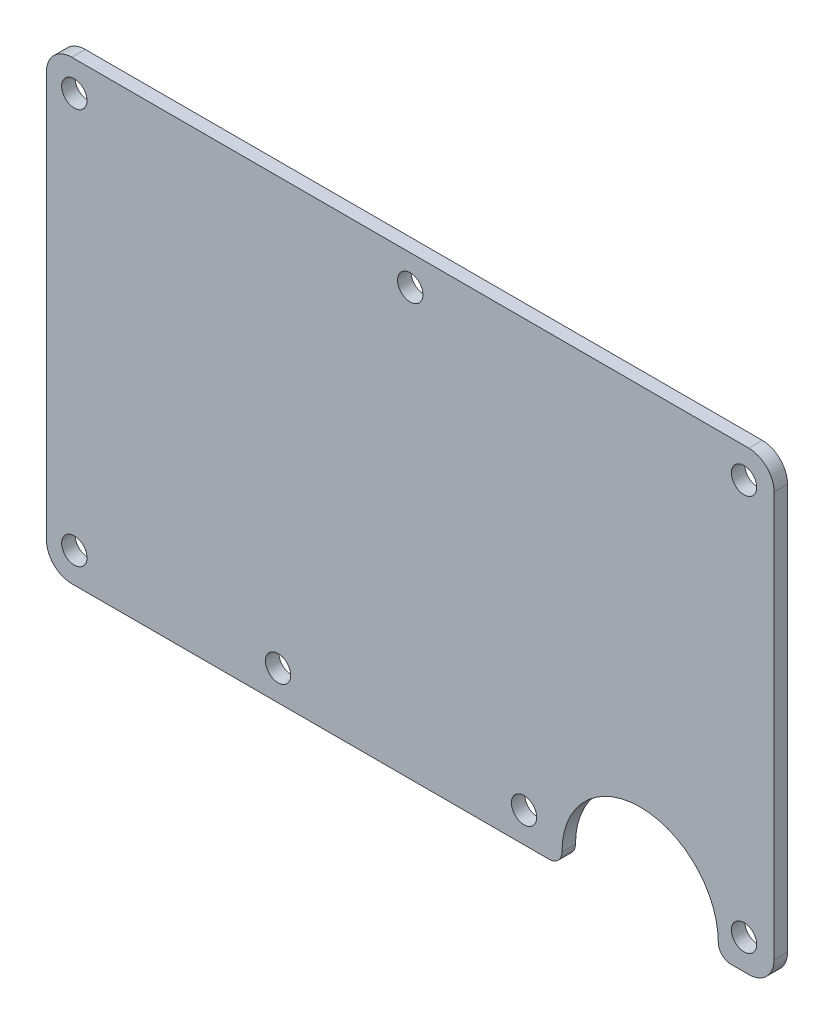
ISO-10303-21;
HEADER;
FILE_DESCRIPTION(('STEP AP214'),'2;1');
FILE_NAME('part.step','',(''),(''),'','','');
FILE_SCHEMA(('AUTOMOTIVE_DESIGN { 1 0 10303 214 1 1 1 1 }'));
ENDSEC;
DATA;
#1=APPLICATION_CONTEXT('core data for automotive mechanical design processes');
#2=APPLICATION_PROTOCOL_DEFINITION('international standard','automotive_design',2000,#1);
#3=PRODUCT_CONTEXT('',#1,'mechanical');
#4=PRODUCT('Part','Part','',(#3));
#5=PRODUCT_RELATED_PRODUCT_CATEGORY('part','',(#4));
#6=PRODUCT_DEFINITION_FORMATION('','',#4);
#7=PRODUCT_DEFINITION_CONTEXT('part definition',#1,'design');
#8=PRODUCT_DEFINITION('design','',#6,#7);
#9=PRODUCT_DEFINITION_SHAPE('','',#8);
#10=(LENGTH_UNIT() NAMED_UNIT(*) SI_UNIT(.MILLI.,.METRE.));
#11=(NAMED_UNIT(*) PLANE_ANGLE_UNIT() SI_UNIT($,.RADIAN.));
#12=(NAMED_UNIT(*) SI_UNIT($,.STERADIAN.) SOLID_ANGLE_UNIT());
#13=UNCERTAINTY_MEASURE_WITH_UNIT(LENGTH_MEASURE(1.E-05),#10,'distance_accuracy_value','');
#14=(GEOMETRIC_REPRESENTATION_CONTEXT(3) GLOBAL_UNCERTAINTY_ASSIGNED_CONTEXT((#13)) GLOBAL_UNIT_ASSIGNED_CONTEXT((#10,
#11,#12)) REPRESENTATION_CONTEXT('',''));
#15=CARTESIAN_POINT('',(0.,0.,0.));
#16=DIRECTION('',(0.,0.,1.));
#17=DIRECTION('',(1.,0.,0.));
#18=AXIS2_PLACEMENT_3D('',#15,#16,#17);
#19=CARTESIAN_POINT('',(3.,50.9476,0.));
#20=DIRECTION('',(0.,0.,1.));
#21=DIRECTION('',(1.,0.,0.));
#22=AXIS2_PLACEMENT_3D('',#19,#20,#21);
#23=CYLINDRICAL_SURFACE('',#22,3.);
#24=CARTESIAN_POINT('',(3.,50.9476,1.6));
#25=DIRECTION('',(0.,0.,1.));
#26=DIRECTION('',(1.,0.,0.));
#27=AXIS2_PLACEMENT_3D('',#24,#25,#26);
#28=CIRCLE('',#27,3.);
#29=CARTESIAN_POINT('',(3.,53.9476,1.6));
#30=VERTEX_POINT('',#29);
#31=CARTESIAN_POINT('',(0.,50.9476,1.6));
#32=VERTEX_POINT('',#31);
#33=EDGE_CURVE('E155',#30,#32,#28,.T.);
#34=ORIENTED_EDGE('',*,*,#33,.F.);
#35=DIRECTION('',(0.,0.,1.));
#36=VECTOR('',#35,1.);
#37=CARTESIAN_POINT('',(3.,53.9476,0.));
#38=LINE('',#37,#36);
#39=CARTESIAN_POINT('',(3.,53.9476,0.));
#40=VERTEX_POINT('',#39);
#41=EDGE_CURVE('E11',#40,#30,#38,.T.);
#42=ORIENTED_EDGE('',*,*,#41,.F.);
#43=CARTESIAN_POINT('',(3.,50.9476,0.));
#44=DIRECTION('',(0.,0.,1.));
#45=DIRECTION('',(1.,0.,0.));
#46=AXIS2_PLACEMENT_3D('',#43,#44,#45);
#47=CIRCLE('',#46,3.);
#48=CARTESIAN_POINT('',(0.,50.9476,0.));
#49=VERTEX_POINT('',#48);
#50=EDGE_CURVE('E188',#40,#49,#47,.T.);
#51=ORIENTED_EDGE('',*,*,#50,.T.);
#52=DIRECTION('',(0.,0.,1.));
#53=VECTOR('',#52,1.);
#54=CARTESIAN_POINT('',(0.,50.9476,0.));
#55=LINE('',#54,#53);
#56=EDGE_CURVE('E37',#49,#32,#55,.T.);
#57=ORIENTED_EDGE('',*,*,#56,.T.);
#58=EDGE_LOOP('',(#34,#42,#51,#57));
#59=FACE_BOUND('',#58,.T.);
#60=ADVANCED_FACE('F34',(#59),#23,.T.);
#61=CARTESIAN_POINT('',(83.1,53.9476,0.));
#62=DIRECTION('',(0.,1.,0.));
#63=DIRECTION('',(0.,0.,1.));
#64=AXIS2_PLACEMENT_3D('',#61,#62,#63);
#65=PLANE('',#64);
#66=DIRECTION('',(-1.,0.,0.));
#67=VECTOR('',#66,1.);
#68=CARTESIAN_POINT('',(83.1,53.9476,1.6));
#69=LINE('',#68,#67);
#70=CARTESIAN_POINT('',(83.1,53.9476,1.6));
#71=VERTEX_POINT('',#70);
#72=EDGE_CURVE('E186',#71,#30,#69,.T.);
#73=ORIENTED_EDGE('',*,*,#72,.F.);
#74=DIRECTION('',(0.,0.,1.));
#75=VECTOR('',#74,1.);
#76=CARTESIAN_POINT('',(83.1,53.9476,0.));
#77=LINE('',#76,#75);
#78=CARTESIAN_POINT('',(83.1,53.9476,0.));
#79=VERTEX_POINT('',#78);
#80=EDGE_CURVE('E43',#79,#71,#77,.T.);
#81=ORIENTED_EDGE('',*,*,#80,.F.);
#82=DIRECTION('',(-1.,0.,0.));
#83=VECTOR('',#82,1.);
#84=CARTESIAN_POINT('',(83.1,53.9476,0.));
#85=LINE('',#84,#83);
#86=EDGE_CURVE('E145',#79,#40,#85,.T.);
#87=ORIENTED_EDGE('',*,*,#86,.T.);
#88=ORIENTED_EDGE('',*,*,#41,.T.);
#89=EDGE_LOOP('',(#73,#81,#87,#88));
#90=FACE_BOUND('',#89,.T.);
#91=ADVANCED_FACE('F208',(#90),#65,.T.);
#92=CARTESIAN_POINT('',(83.1,50.9476,0.));
#93=DIRECTION('',(0.,0.,1.));
#94=DIRECTION('',(1.,0.,0.));
#95=AXIS2_PLACEMENT_3D('',#92,#93,#94);
#96=CYLINDRICAL_SURFACE('',#95,3.);
#97=CARTESIAN_POINT('',(83.1,50.9476,1.6));
#98=DIRECTION('',(0.,0.,1.));
#99=DIRECTION('',(1.,0.,0.));
#100=AXIS2_PLACEMENT_3D('',#97,#98,#99);
#101=CIRCLE('',#100,3.);
#102=CARTESIAN_POINT('',(86.1,50.9476,1.6));
#103=VERTEX_POINT('',#102);
#104=EDGE_CURVE('E132',#103,#71,#101,.T.);
#105=ORIENTED_EDGE('',*,*,#104,.F.);
#106=DIRECTION('',(0.,0.,1.));
#107=VECTOR('',#106,1.);
#108=CARTESIAN_POINT('',(86.1,50.9476,0.));
#109=LINE('',#108,#107);
#110=CARTESIAN_POINT('',(86.1,50.9476,0.));
#111=VERTEX_POINT('',#110);
#112=EDGE_CURVE('E127',#111,#103,#109,.T.);
#113=ORIENTED_EDGE('',*,*,#112,.F.);
#114=CARTESIAN_POINT('',(83.1,50.9476,0.));
#115=DIRECTION('',(0.,0.,1.));
#116=DIRECTION('',(1.,0.,0.));
#117=AXIS2_PLACEMENT_3D('',#114,#115,#116);
#118=CIRCLE('',#117,3.);
#119=EDGE_CURVE('E130',#111,#79,#118,.T.);
#120=ORIENTED_EDGE('',*,*,#119,.T.);
#121=ORIENTED_EDGE('',*,*,#80,.T.);
#122=EDGE_LOOP('',(#105,#113,#120,#121));
#123=FACE_BOUND('',#122,.T.);
#124=ADVANCED_FACE('F129',(#123),#96,.T.);
#125=CARTESIAN_POINT('',(86.1,3.,0.));
#126=DIRECTION('',(1.,0.,0.));
#127=DIRECTION('',(0.,0.,-1.));
#128=AXIS2_PLACEMENT_3D('',#125,#126,#127);
#129=PLANE('',#128);
#130=DIRECTION('',(0.,1.,0.));
#131=VECTOR('',#130,1.);
#132=CARTESIAN_POINT('',(86.1,3.,1.6));
#133=LINE('',#132,#131);
#134=CARTESIAN_POINT('',(86.1,3.,1.6));
#135=VERTEX_POINT('',#134);
#136=EDGE_CURVE('E183',#135,#103,#133,.T.);
#137=ORIENTED_EDGE('',*,*,#136,.F.);
#138=DIRECTION('',(0.,0.,1.));
#139=VECTOR('',#138,1.);
#140=CARTESIAN_POINT('',(86.1,3.,0.));
#141=LINE('',#140,#139);
#142=CARTESIAN_POINT('',(86.1,3.,0.));
#143=VERTEX_POINT('',#142);
#144=EDGE_CURVE('E137',#143,#135,#141,.T.);
#145=ORIENTED_EDGE('',*,*,#144,.F.);
#146=DIRECTION('',(0.,1.,0.));
#147=VECTOR('',#146,1.);
#148=CARTESIAN_POINT('',(86.1,3.,0.));
#149=LINE('',#148,#147);
#150=EDGE_CURVE('E143',#143,#111,#149,.T.);
#151=ORIENTED_EDGE('',*,*,#150,.T.);
#152=ORIENTED_EDGE('',*,*,#112,.T.);
#153=EDGE_LOOP('',(#137,#145,#151,#152));
#154=FACE_BOUND('',#153,.T.);
#155=ADVANCED_FACE('F147',(#154),#129,.T.);
#156=CARTESIAN_POINT('',(83.1,3.,0.));
#157=DIRECTION('',(0.,0.,1.));
#158=DIRECTION('',(1.,0.,0.));
#159=AXIS2_PLACEMENT_3D('',#156,#157,#158);
#160=CYLINDRICAL_SURFACE('',#159,3.);
#161=CARTESIAN_POINT('',(83.1,3.,1.6));
#162=DIRECTION('',(0.,0.,1.));
#163=DIRECTION('',(1.,0.,0.));
#164=AXIS2_PLACEMENT_3D('',#161,#162,#163);
#165=CIRCLE('',#164,3.);
#166=CARTESIAN_POINT('',(83.1,0.,1.6));
#167=VERTEX_POINT('',#166);
#168=EDGE_CURVE('E180',#167,#135,#165,.T.);
#169=ORIENTED_EDGE('',*,*,#168,.F.);
#170=DIRECTION('',(0.,0.,1.));
#171=VECTOR('',#170,1.);
#172=CARTESIAN_POINT('',(83.1,0.,0.));
#173=LINE('',#172,#171);
#174=CARTESIAN_POINT('',(83.1,0.,0.));
#175=VERTEX_POINT('',#174);
#176=EDGE_CURVE('E192',#175,#167,#173,.T.);
#177=ORIENTED_EDGE('',*,*,#176,.F.);
#178=CARTESIAN_POINT('',(83.1,3.,0.));
#179=DIRECTION('',(0.,0.,1.));
#180=DIRECTION('',(1.,0.,0.));
#181=AXIS2_PLACEMENT_3D('',#178,#179,#180);
#182=CIRCLE('',#181,3.);
#183=EDGE_CURVE('E148',#175,#143,#182,.T.);
#184=ORIENTED_EDGE('',*,*,#183,.T.);
#185=ORIENTED_EDGE('',*,*,#144,.T.);
#186=EDGE_LOOP('',(#169,#177,#184,#185));
#187=FACE_BOUND('',#186,.T.);
#188=ADVANCED_FACE('F221',(#187),#160,.T.);
#189=CARTESIAN_POINT('',(81.,0.,0.));
#190=DIRECTION('',(0.,-1.,0.));
#191=DIRECTION('',(0.,0.,-1.));
#192=AXIS2_PLACEMENT_3D('',#189,#190,#191);
#193=PLANE('',#192);
#194=DIRECTION('',(1.,0.,0.));
#195=VECTOR('',#194,1.);
#196=CARTESIAN_POINT('',(81.,0.,1.6));
#197=LINE('',#196,#195);
#198=CARTESIAN_POINT('',(81.,0.,1.6));
#199=VERTEX_POINT('',#198);
#200=EDGE_CURVE('E177',#199,#167,#197,.T.);
#201=ORIENTED_EDGE('',*,*,#200,.F.);
#202=DIRECTION('',(0.,0.,1.));
#203=VECTOR('',#202,1.);
#204=CARTESIAN_POINT('',(81.,0.,0.));
#205=LINE('',#204,#203);
#206=CARTESIAN_POINT('',(81.,0.,0.));
#207=VERTEX_POINT('',#206);
#208=EDGE_CURVE('E194',#207,#199,#205,.T.);
#209=ORIENTED_EDGE('',*,*,#208,.F.);
#210=DIRECTION('',(1.,0.,0.));
#211=VECTOR('',#210,1.);
#212=CARTESIAN_POINT('',(81.,0.,0.));
#213=LINE('',#212,#211);
#214=EDGE_CURVE('E150',#207,#175,#213,.T.);
#215=ORIENTED_EDGE('',*,*,#214,.T.);
#216=ORIENTED_EDGE('',*,*,#176,.T.);
#217=EDGE_LOOP('',(#201,#209,#215,#216));
#218=FACE_BOUND('',#217,.T.);
#219=ADVANCED_FACE('F224',(#218),#193,.T.);
#220=CARTESIAN_POINT('',(81.,1.5,0.));
#221=DIRECTION('',(0.,0.,1.));
#222=DIRECTION('',(1.,0.,0.));
#223=AXIS2_PLACEMENT_3D('',#220,#221,#222);
#224=CYLINDRICAL_SURFACE('',#223,1.5);
#225=CARTESIAN_POINT('',(81.,1.5,1.6));
#226=DIRECTION('',(0.,0.,1.));
#227=DIRECTION('',(1.,0.,0.));
#228=AXIS2_PLACEMENT_3D('',#225,#226,#227);
#229=CIRCLE('',#228,1.5);
#230=CARTESIAN_POINT('',(79.5,1.5,1.6));
#231=VERTEX_POINT('',#230);
#232=EDGE_CURVE('E174',#231,#199,#229,.T.);
#233=ORIENTED_EDGE('',*,*,#232,.F.);
#234=DIRECTION('',(0.,0.,1.));
#235=VECTOR('',#234,1.);
#236=CARTESIAN_POINT('',(79.5,1.5,0.));
#237=LINE('',#236,#235);
#238=CARTESIAN_POINT('',(79.5,1.5,0.));
#239=VERTEX_POINT('',#238);
#240=EDGE_CURVE('E196',#239,#231,#237,.T.);
#241=ORIENTED_EDGE('',*,*,#240,.F.);
#242=CARTESIAN_POINT('',(81.,1.5,0.));
#243=DIRECTION('',(0.,0.,1.));
#244=DIRECTION('',(1.,0.,0.));
#245=AXIS2_PLACEMENT_3D('',#242,#243,#244);
#246=CIRCLE('',#245,1.5);
#247=EDGE_CURVE('E348',#239,#207,#246,.T.);
#248=ORIENTED_EDGE('',*,*,#247,.T.);
#249=ORIENTED_EDGE('',*,*,#208,.T.);
#250=EDGE_LOOP('',(#233,#241,#248,#249));
#251=FACE_BOUND('',#250,.T.);
#252=ADVANCED_FACE('F228',(#251),#224,.T.);
#253=CARTESIAN_POINT('',(70.25,1.5,0.));
#254=DIRECTION('',(0.,0.,1.));
#255=DIRECTION('',(1.,0.,0.));
#256=AXIS2_PLACEMENT_3D('',#253,#254,#255);
#257=CYLINDRICAL_SURFACE('',#256,9.25);
#258=CARTESIAN_POINT('',(70.25,1.5,1.6));
#259=DIRECTION('',(0.,0.,-1.));
#260=DIRECTION('',(-1.,0.,0.));
#261=AXIS2_PLACEMENT_3D('',#258,#259,#260);
#262=CIRCLE('',#261,9.25);
#263=CARTESIAN_POINT('',(61.,1.5,1.6));
#264=VERTEX_POINT('',#263);
#265=EDGE_CURVE('E171',#264,#231,#262,.T.);
#266=ORIENTED_EDGE('',*,*,#265,.F.);
#267=DIRECTION('',(0.,0.,1.));
#268=VECTOR('',#267,1.);
#269=CARTESIAN_POINT('',(61.,1.5,0.));
#270=LINE('',#269,#268);
#271=CARTESIAN_POINT('',(61.,1.5,0.));
#272=VERTEX_POINT('',#271);
#273=EDGE_CURVE('E198',#272,#264,#270,.T.);
#274=ORIENTED_EDGE('',*,*,#273,.F.);
#275=CARTESIAN_POINT('',(70.25,1.5,0.));
#276=DIRECTION('',(0.,0.,-1.));
#277=DIRECTION('',(-1.,0.,0.));
#278=AXIS2_PLACEMENT_3D('',#275,#276,#277);
#279=CIRCLE('',#278,9.25);
#280=EDGE_CURVE('E345',#272,#239,#279,.T.);
#281=ORIENTED_EDGE('',*,*,#280,.T.);
#282=ORIENTED_EDGE('',*,*,#240,.T.);
#283=EDGE_LOOP('',(#266,#274,#281,#282));
#284=FACE_BOUND('',#283,.T.);
#285=ADVANCED_FACE('F232',(#284),#257,.F.);
#286=CARTESIAN_POINT('',(59.5,1.5,0.));
#287=DIRECTION('',(0.,0.,1.));
#288=DIRECTION('',(1.,0.,0.));
#289=AXIS2_PLACEMENT_3D('',#286,#287,#288);
#290=CYLINDRICAL_SURFACE('',#289,1.5);
#291=CARTESIAN_POINT('',(59.5,1.5,1.6));
#292=DIRECTION('',(0.,0.,1.));
#293=DIRECTION('',(1.,0.,0.));
#294=AXIS2_PLACEMENT_3D('',#291,#292,#293);
#295=CIRCLE('',#294,1.5);
#296=CARTESIAN_POINT('',(59.5,0.,1.6));
#297=VERTEX_POINT('',#296);
#298=EDGE_CURVE('E168',#297,#264,#295,.T.);
#299=ORIENTED_EDGE('',*,*,#298,.F.);
#300=DIRECTION('',(0.,0.,1.));
#301=VECTOR('',#300,1.);
#302=CARTESIAN_POINT('',(59.5,0.,0.));
#303=LINE('',#302,#301);
#304=CARTESIAN_POINT('',(59.5,0.,0.));
#305=VERTEX_POINT('',#304);
#306=EDGE_CURVE('E200',#305,#297,#303,.T.);
#307=ORIENTED_EDGE('',*,*,#306,.F.);
#308=CARTESIAN_POINT('',(59.5,1.5,0.));
#309=DIRECTION('',(0.,0.,1.));
#310=DIRECTION('',(1.,0.,0.));
#311=AXIS2_PLACEMENT_3D('',#308,#309,#310);
#312=CIRCLE('',#311,1.5);
#313=EDGE_CURVE('E342',#305,#272,#312,.T.);
#314=ORIENTED_EDGE('',*,*,#313,.T.);
#315=ORIENTED_EDGE('',*,*,#273,.T.);
#316=EDGE_LOOP('',(#299,#307,#314,#315));
#317=FACE_BOUND('',#316,.T.);
#318=ADVANCED_FACE('F236',(#317),#290,.T.);
#319=CARTESIAN_POINT('',(3.,0.,0.));
#320=DIRECTION('',(0.,-1.,0.));
#321=DIRECTION('',(0.,0.,-1.));
#322=AXIS2_PLACEMENT_3D('',#319,#320,#321);
#323=PLANE('',#322);
#324=DIRECTION('',(1.,0.,0.));
#325=VECTOR('',#324,1.);
#326=CARTESIAN_POINT('',(3.,0.,1.6));
#327=LINE('',#326,#325);
#328=CARTESIAN_POINT('',(3.,0.,1.6));
#329=VERTEX_POINT('',#328);
#330=EDGE_CURVE('E165',#329,#297,#327,.T.);
#331=ORIENTED_EDGE('',*,*,#330,.F.);
#332=DIRECTION('',(0.,0.,1.));
#333=VECTOR('',#332,1.);
#334=CARTESIAN_POINT('',(3.,0.,0.));
#335=LINE('',#334,#333);
#336=CARTESIAN_POINT('',(3.,0.,0.));
#337=VERTEX_POINT('',#336);
#338=EDGE_CURVE('E202',#337,#329,#335,.T.);
#339=ORIENTED_EDGE('',*,*,#338,.F.);
#340=DIRECTION('',(1.,0.,0.));
#341=VECTOR('',#340,1.);
#342=CARTESIAN_POINT('',(3.,0.,0.));
#343=LINE('',#342,#341);
#344=EDGE_CURVE('E339',#337,#305,#343,.T.);
#345=ORIENTED_EDGE('',*,*,#344,.T.);
#346=ORIENTED_EDGE('',*,*,#306,.T.);
#347=EDGE_LOOP('',(#331,#339,#345,#346));
#348=FACE_BOUND('',#347,.T.);
#349=ADVANCED_FACE('F240',(#348),#323,.T.);
#350=CARTESIAN_POINT('',(3.,3.,0.));
#351=DIRECTION('',(0.,0.,1.));
#352=DIRECTION('',(1.,0.,0.));
#353=AXIS2_PLACEMENT_3D('',#350,#351,#352);
#354=CYLINDRICAL_SURFACE('',#353,3.);
#355=CARTESIAN_POINT('',(3.,3.,1.6));
#356=DIRECTION('',(0.,0.,1.));
#357=DIRECTION('',(1.,0.,0.));
#358=AXIS2_PLACEMENT_3D('',#355,#356,#357);
#359=CIRCLE('',#358,3.);
#360=CARTESIAN_POINT('',(0.,3.,1.6));
#361=VERTEX_POINT('',#360);
#362=EDGE_CURVE('E162',#361,#329,#359,.T.);
#363=ORIENTED_EDGE('',*,*,#362,.F.);
#364=DIRECTION('',(0.,0.,1.));
#365=VECTOR('',#364,1.);
#366=CARTESIAN_POINT('',(0.,3.,0.));
#367=LINE('',#366,#365);
#368=CARTESIAN_POINT('',(0.,3.,0.));
#369=VERTEX_POINT('',#368);
#370=EDGE_CURVE('E203',#369,#361,#367,.T.);
#371=ORIENTED_EDGE('',*,*,#370,.F.);
#372=CARTESIAN_POINT('',(3.,3.,0.));
#373=DIRECTION('',(0.,0.,1.));
#374=DIRECTION('',(1.,0.,0.));
#375=AXIS2_PLACEMENT_3D('',#372,#373,#374);
#376=CIRCLE('',#375,3.);
#377=EDGE_CURVE('E336',#369,#337,#376,.T.);
#378=ORIENTED_EDGE('',*,*,#377,.T.);
#379=ORIENTED_EDGE('',*,*,#338,.T.);
#380=EDGE_LOOP('',(#363,#371,#378,#379));
#381=FACE_BOUND('',#380,.T.);
#382=ADVANCED_FACE('F244',(#381),#354,.T.);
#383=CARTESIAN_POINT('',(0.,50.9476,0.));
#384=DIRECTION('',(-1.,0.,0.));
#385=DIRECTION('',(0.,0.,1.));
#386=AXIS2_PLACEMENT_3D('',#383,#384,#385);
#387=PLANE('',#386);
#388=DIRECTION('',(0.,-1.,0.));
#389=VECTOR('',#388,1.);
#390=CARTESIAN_POINT('',(0.,50.9476,1.6));
#391=LINE('',#390,#389);
#392=EDGE_CURVE('E158',#32,#361,#391,.T.);
#393=ORIENTED_EDGE('',*,*,#392,.F.);
#394=ORIENTED_EDGE('',*,*,#56,.F.);
#395=DIRECTION('',(0.,-1.,0.));
#396=VECTOR('',#395,1.);
#397=CARTESIAN_POINT('',(0.,50.9476,0.));
#398=LINE('',#397,#396);
#399=EDGE_CURVE('E334',#49,#369,#398,.T.);
#400=ORIENTED_EDGE('',*,*,#399,.T.);
#401=ORIENTED_EDGE('',*,*,#370,.T.);
#402=EDGE_LOOP('',(#393,#394,#400,#401));
#403=FACE_BOUND('',#402,.T.);
#404=ADVANCED_FACE('F205',(#403),#387,.T.);
#405=CARTESIAN_POINT('',(3.,50.9476,0.));
#406=DIRECTION('',(0.,0.,1.));
#407=DIRECTION('',(1.,0.,0.));
#408=AXIS2_PLACEMENT_3D('',#405,#406,#407);
#409=PLANE('',#408);
#410=CARTESIAN_POINT('',(43.05,50.3904,0.));
#411=DIRECTION('',(0.,0.,1.));
#412=DIRECTION('',(-1.,0.,0.));
#413=AXIS2_PLACEMENT_3D('',#410,#411,#412);
#414=CIRCLE('',#413,1.5);
#415=CARTESIAN_POINT('',(41.55,50.3904,0.));
#416=VERTEX_POINT('',#415);
#417=EDGE_CURVE('E291',#416,#416,#414,.T.);
#418=ORIENTED_EDGE('',*,*,#417,.T.);
#419=EDGE_LOOP('',(#418));
#420=FACE_BOUND('',#419,.T.);
#421=CARTESIAN_POINT('',(56.515,3.556,0.));
#422=DIRECTION('',(0.,0.,1.));
#423=DIRECTION('',(-1.,0.,0.));
#424=AXIS2_PLACEMENT_3D('',#421,#422,#423);
#425=CIRCLE('',#424,1.5);
#426=CARTESIAN_POINT('',(55.015,3.556,0.));
#427=VERTEX_POINT('',#426);
#428=EDGE_CURVE('E299',#427,#427,#425,.T.);
#429=ORIENTED_EDGE('',*,*,#428,.T.);
#430=EDGE_LOOP('',(#429));
#431=FACE_BOUND('',#430,.T.);
#432=CARTESIAN_POINT('',(27.4096,3.556,0.));
#433=DIRECTION('',(0.,0.,1.));
#434=DIRECTION('',(-1.,0.,0.));
#435=AXIS2_PLACEMENT_3D('',#432,#433,#434);
#436=CIRCLE('',#435,1.4999995);
#437=CARTESIAN_POINT('',(25.9096005,3.556,0.));
#438=VERTEX_POINT('',#437);
#439=EDGE_CURVE('E305',#438,#438,#436,.T.);
#440=ORIENTED_EDGE('',*,*,#439,.T.);
#441=EDGE_LOOP('',(#440));
#442=FACE_BOUND('',#441,.T.);
#443=CARTESIAN_POINT('',(82.55,50.3904,0.));
#444=DIRECTION('',(0.,0.,1.));
#445=DIRECTION('',(-1.,0.,0.));
#446=AXIS2_PLACEMENT_3D('',#443,#444,#445);
#447=CIRCLE('',#446,1.5);
#448=CARTESIAN_POINT('',(81.05,50.3904,0.));
#449=VERTEX_POINT('',#448);
#450=EDGE_CURVE('E311',#449,#449,#447,.T.);
#451=ORIENTED_EDGE('',*,*,#450,.T.);
#452=EDGE_LOOP('',(#451));
#453=FACE_BOUND('',#452,.T.);
#454=CARTESIAN_POINT('',(82.55,3.556,0.));
#455=DIRECTION('',(0.,0.,1.));
#456=DIRECTION('',(-1.,0.,0.));
#457=AXIS2_PLACEMENT_3D('',#454,#455,#456);
#458=CIRCLE('',#457,1.5);
#459=CARTESIAN_POINT('',(81.05,3.556,0.));
#460=VERTEX_POINT('',#459);
#461=EDGE_CURVE('E317',#460,#460,#458,.T.);
#462=ORIENTED_EDGE('',*,*,#461,.T.);
#463=EDGE_LOOP('',(#462));
#464=FACE_BOUND('',#463,.T.);
#465=CARTESIAN_POINT('',(3.302,3.556,0.));
#466=DIRECTION('',(0.,0.,1.));
#467=DIRECTION('',(-1.,0.,0.));
#468=AXIS2_PLACEMENT_3D('',#465,#466,#467);
#469=CIRCLE('',#468,1.5);
#470=CARTESIAN_POINT('',(1.802,3.556,0.));
#471=VERTEX_POINT('',#470);
#472=EDGE_CURVE('E323',#471,#471,#469,.T.);
#473=ORIENTED_EDGE('',*,*,#472,.T.);
#474=EDGE_LOOP('',(#473));
#475=FACE_BOUND('',#474,.T.);
#476=CARTESIAN_POINT('',(3.302,50.3904,0.));
#477=DIRECTION('',(0.,0.,1.));
#478=DIRECTION('',(-1.,0.,0.));
#479=AXIS2_PLACEMENT_3D('',#476,#477,#478);
#480=CIRCLE('',#479,1.5);
#481=CARTESIAN_POINT('',(1.802,50.3904,0.));
#482=VERTEX_POINT('',#481);
#483=EDGE_CURVE('E159',#482,#482,#480,.T.);
#484=ORIENTED_EDGE('',*,*,#483,.T.);
#485=EDGE_LOOP('',(#484));
#486=FACE_BOUND('',#485,.T.);
#487=ORIENTED_EDGE('',*,*,#50,.F.);
#488=ORIENTED_EDGE('',*,*,#86,.F.);
#489=ORIENTED_EDGE('',*,*,#119,.F.);
#490=ORIENTED_EDGE('',*,*,#150,.F.);
#491=ORIENTED_EDGE('',*,*,#183,.F.);
#492=ORIENTED_EDGE('',*,*,#214,.F.);
#493=ORIENTED_EDGE('',*,*,#247,.F.);
#494=ORIENTED_EDGE('',*,*,#280,.F.);
#495=ORIENTED_EDGE('',*,*,#313,.F.);
#496=ORIENTED_EDGE('',*,*,#344,.F.);
#497=ORIENTED_EDGE('',*,*,#377,.F.);
#498=ORIENTED_EDGE('',*,*,#399,.F.);
#499=EDGE_LOOP('',(#487,#488,#489,#490,#491,#492,#493,#494,#495,#496,#497,#498));
#500=FACE_BOUND('',#499,.T.);
#501=ADVANCED_FACE('F141',(#420,#431,#442,#453,#464,#475,#486,#500),#409,.F.);
#502=CARTESIAN_POINT('',(3.,50.9476,1.6));
#503=DIRECTION('',(0.,0.,1.));
#504=DIRECTION('',(1.,0.,0.));
#505=AXIS2_PLACEMENT_3D('',#502,#503,#504);
#506=PLANE('',#505);
#507=CARTESIAN_POINT('',(43.05,50.3904,1.6));
#508=DIRECTION('',(0.,0.,1.));
#509=DIRECTION('',(-1.,0.,0.));
#510=AXIS2_PLACEMENT_3D('',#507,#508,#509);
#511=CIRCLE('',#510,1.5);
#512=CARTESIAN_POINT('',(41.55,50.3904,1.6));
#513=VERTEX_POINT('',#512);
#514=EDGE_CURVE('E294',#513,#513,#511,.T.);
#515=ORIENTED_EDGE('',*,*,#514,.F.);
#516=EDGE_LOOP('',(#515));
#517=FACE_BOUND('',#516,.T.);
#518=CARTESIAN_POINT('',(56.515,3.556,1.6));
#519=DIRECTION('',(0.,0.,1.));
#520=DIRECTION('',(-1.,0.,0.));
#521=AXIS2_PLACEMENT_3D('',#518,#519,#520);
#522=CIRCLE('',#521,1.5);
#523=CARTESIAN_POINT('',(55.015,3.556,1.6));
#524=VERTEX_POINT('',#523);
#525=EDGE_CURVE('E296',#524,#524,#522,.T.);
#526=ORIENTED_EDGE('',*,*,#525,.F.);
#527=EDGE_LOOP('',(#526));
#528=FACE_BOUND('',#527,.T.);
#529=CARTESIAN_POINT('',(27.4096,3.556,1.6));
#530=DIRECTION('',(0.,0.,1.));
#531=DIRECTION('',(-1.,0.,0.));
#532=AXIS2_PLACEMENT_3D('',#529,#530,#531);
#533=CIRCLE('',#532,1.4999995);
#534=CARTESIAN_POINT('',(25.9096005,3.556,1.6));
#535=VERTEX_POINT('',#534);
#536=EDGE_CURVE('E302',#535,#535,#533,.T.);
#537=ORIENTED_EDGE('',*,*,#536,.F.);
#538=EDGE_LOOP('',(#537));
#539=FACE_BOUND('',#538,.T.);
#540=CARTESIAN_POINT('',(82.55,50.3904,1.6));
#541=DIRECTION('',(0.,0.,1.));
#542=DIRECTION('',(-1.,0.,0.));
#543=AXIS2_PLACEMENT_3D('',#540,#541,#542);
#544=CIRCLE('',#543,1.5);
#545=CARTESIAN_POINT('',(81.05,50.3904,1.6));
#546=VERTEX_POINT('',#545);
#547=EDGE_CURVE('E308',#546,#546,#544,.T.);
#548=ORIENTED_EDGE('',*,*,#547,.F.);
#549=EDGE_LOOP('',(#548));
#550=FACE_BOUND('',#549,.T.);
#551=CARTESIAN_POINT('',(82.55,3.556,1.6));
#552=DIRECTION('',(0.,0.,1.));
#553=DIRECTION('',(-1.,0.,0.));
#554=AXIS2_PLACEMENT_3D('',#551,#552,#553);
#555=CIRCLE('',#554,1.5);
#556=CARTESIAN_POINT('',(81.05,3.556,1.6));
#557=VERTEX_POINT('',#556);
#558=EDGE_CURVE('E314',#557,#557,#555,.T.);
#559=ORIENTED_EDGE('',*,*,#558,.F.);
#560=EDGE_LOOP('',(#559));
#561=FACE_BOUND('',#560,.T.);
#562=CARTESIAN_POINT('',(3.302,3.556,1.6));
#563=DIRECTION('',(0.,0.,1.));
#564=DIRECTION('',(-1.,0.,0.));
#565=AXIS2_PLACEMENT_3D('',#562,#563,#564);
#566=CIRCLE('',#565,1.5);
#567=CARTESIAN_POINT('',(1.802,3.556,1.6));
#568=VERTEX_POINT('',#567);
#569=EDGE_CURVE('E320',#568,#568,#566,.T.);
#570=ORIENTED_EDGE('',*,*,#569,.F.);
#571=EDGE_LOOP('',(#570));
#572=FACE_BOUND('',#571,.T.);
#573=CARTESIAN_POINT('',(3.302,50.3904,1.6));
#574=DIRECTION('',(0.,0.,1.));
#575=DIRECTION('',(-1.,0.,0.));
#576=AXIS2_PLACEMENT_3D('',#573,#574,#575);
#577=CIRCLE('',#576,1.5);
#578=CARTESIAN_POINT('',(1.802,50.3904,1.6));
#579=VERTEX_POINT('',#578);
#580=EDGE_CURVE('E326',#579,#579,#577,.T.);
#581=ORIENTED_EDGE('',*,*,#580,.F.);
#582=EDGE_LOOP('',(#581));
#583=FACE_BOUND('',#582,.T.);
#584=ORIENTED_EDGE('',*,*,#33,.T.);
#585=ORIENTED_EDGE('',*,*,#392,.T.);
#586=ORIENTED_EDGE('',*,*,#362,.T.);
#587=ORIENTED_EDGE('',*,*,#330,.T.);
#588=ORIENTED_EDGE('',*,*,#298,.T.);
#589=ORIENTED_EDGE('',*,*,#265,.T.);
#590=ORIENTED_EDGE('',*,*,#232,.T.);
#591=ORIENTED_EDGE('',*,*,#200,.T.);
#592=ORIENTED_EDGE('',*,*,#168,.T.);
#593=ORIENTED_EDGE('',*,*,#136,.T.);
#594=ORIENTED_EDGE('',*,*,#104,.T.);
#595=ORIENTED_EDGE('',*,*,#72,.T.);
#596=EDGE_LOOP('',(#584,#585,#586,#587,#588,#589,#590,#591,#592,#593,#594,#595));
#597=FACE_BOUND('',#596,.T.);
#598=ADVANCED_FACE('F207',(#517,#528,#539,#550,#561,#572,#583,#597),#506,.T.);
#599=CARTESIAN_POINT('',(3.302,50.3904,0.));
#600=DIRECTION('',(0.,0.,1.));
#601=DIRECTION('',(1.,0.,0.));
#602=AXIS2_PLACEMENT_3D('',#599,#600,#601);
#603=CYLINDRICAL_SURFACE('',#602,1.5);
#604=ORIENTED_EDGE('',*,*,#483,.F.);
#605=EDGE_LOOP('',(#604));
#606=FACE_BOUND('',#605,.T.);
#607=ORIENTED_EDGE('',*,*,#580,.T.);
#608=EDGE_LOOP('',(#607));
#609=FACE_BOUND('',#608,.T.);
#610=ADVANCED_FACE('F256',(#606,#609),#603,.F.);
#611=CARTESIAN_POINT('',(3.302,3.556,0.));
#612=DIRECTION('',(0.,0.,1.));
#613=DIRECTION('',(1.,0.,0.));
#614=AXIS2_PLACEMENT_3D('',#611,#612,#613);
#615=CYLINDRICAL_SURFACE('',#614,1.5);
#616=ORIENTED_EDGE('',*,*,#472,.F.);
#617=EDGE_LOOP('',(#616));
#618=FACE_BOUND('',#617,.T.);
#619=ORIENTED_EDGE('',*,*,#569,.T.);
#620=EDGE_LOOP('',(#619));
#621=FACE_BOUND('',#620,.T.);
#622=ADVANCED_FACE('F263',(#618,#621),#615,.F.);
#623=CARTESIAN_POINT('',(82.55,3.556,0.));
#624=DIRECTION('',(0.,0.,1.));
#625=DIRECTION('',(1.,0.,0.));
#626=AXIS2_PLACEMENT_3D('',#623,#624,#625);
#627=CYLINDRICAL_SURFACE('',#626,1.5);
#628=ORIENTED_EDGE('',*,*,#461,.F.);
#629=EDGE_LOOP('',(#628));
#630=FACE_BOUND('',#629,.T.);
#631=ORIENTED_EDGE('',*,*,#558,.T.);
#632=EDGE_LOOP('',(#631));
#633=FACE_BOUND('',#632,.T.);
#634=ADVANCED_FACE('F267',(#630,#633),#627,.F.);
#635=CARTESIAN_POINT('',(82.55,50.3904,0.));
#636=DIRECTION('',(0.,0.,1.));
#637=DIRECTION('',(1.,0.,0.));
#638=AXIS2_PLACEMENT_3D('',#635,#636,#637);
#639=CYLINDRICAL_SURFACE('',#638,1.5);
#640=ORIENTED_EDGE('',*,*,#450,.F.);
#641=EDGE_LOOP('',(#640));
#642=FACE_BOUND('',#641,.T.);
#643=ORIENTED_EDGE('',*,*,#547,.T.);
#644=EDGE_LOOP('',(#643));
#645=FACE_BOUND('',#644,.T.);
#646=ADVANCED_FACE('F271',(#642,#645),#639,.F.);
#647=CARTESIAN_POINT('',(27.4096,3.556,0.));
#648=DIRECTION('',(0.,0.,1.));
#649=DIRECTION('',(1.,0.,0.));
#650=AXIS2_PLACEMENT_3D('',#647,#648,#649);
#651=CYLINDRICAL_SURFACE('',#650,1.4999995);
#652=ORIENTED_EDGE('',*,*,#439,.F.);
#653=EDGE_LOOP('',(#652));
#654=FACE_BOUND('',#653,.T.);
#655=ORIENTED_EDGE('',*,*,#536,.T.);
#656=EDGE_LOOP('',(#655));
#657=FACE_BOUND('',#656,.T.);
#658=ADVANCED_FACE('F275',(#654,#657),#651,.F.);
#659=CARTESIAN_POINT('',(56.515,3.556,0.));
#660=DIRECTION('',(0.,0.,1.));
#661=DIRECTION('',(1.,0.,0.));
#662=AXIS2_PLACEMENT_3D('',#659,#660,#661);
#663=CYLINDRICAL_SURFACE('',#662,1.5);
#664=ORIENTED_EDGE('',*,*,#428,.F.);
#665=EDGE_LOOP('',(#664));
#666=FACE_BOUND('',#665,.T.);
#667=ORIENTED_EDGE('',*,*,#525,.T.);
#668=EDGE_LOOP('',(#667));
#669=FACE_BOUND('',#668,.T.);
#670=ADVANCED_FACE('F279',(#666,#669),#663,.F.);
#671=CARTESIAN_POINT('',(43.05,50.3904,0.));
#672=DIRECTION('',(0.,0.,1.));
#673=DIRECTION('',(1.,0.,0.));
#674=AXIS2_PLACEMENT_3D('',#671,#672,#673);
#675=CYLINDRICAL_SURFACE('',#674,1.5);
#676=ORIENTED_EDGE('',*,*,#417,.F.);
#677=EDGE_LOOP('',(#676));
#678=FACE_BOUND('',#677,.T.);
#679=ORIENTED_EDGE('',*,*,#514,.T.);
#680=EDGE_LOOP('',(#679));
#681=FACE_BOUND('',#680,.T.);
#682=ADVANCED_FACE('F283',(#678,#681),#675,.F.);
#683=CLOSED_SHELL('',(#60,#91,#124,#155,#188,#219,#252,#285,#318,#349,#382,#404,#501,#598,#610,
#622,#634,#646,#658,#670,#682));
#684=MANIFOLD_SOLID_BREP('B2',#683);
#685=ADVANCED_BREP_SHAPE_REPRESENTATION('',(#18,#684),#14);
#686=SHAPE_DEFINITION_REPRESENTATION(#9,#685);
ENDSEC;
END-ISO-10303-21;
